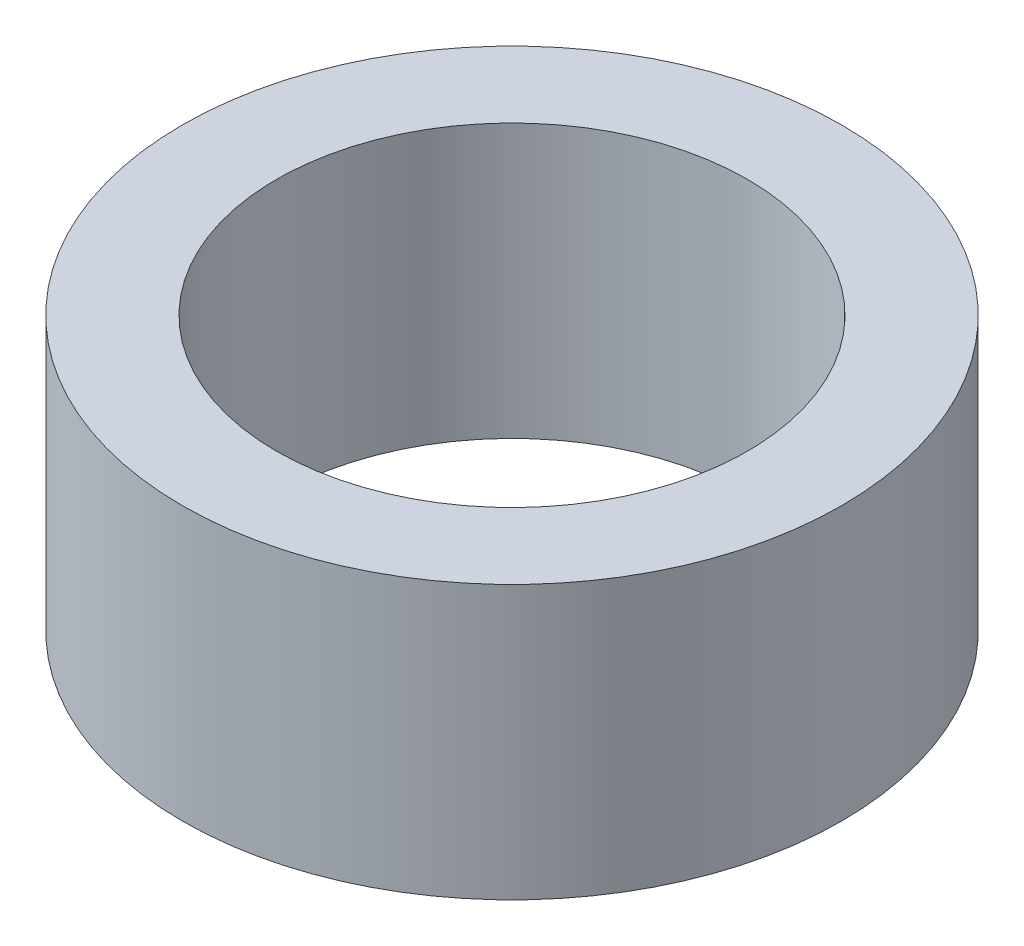
ISO-10303-21;
HEADER;
FILE_DESCRIPTION(('STEP AP214'),'2;1');
FILE_NAME('part.step','',(''),(''),'','','');
FILE_SCHEMA(('AUTOMOTIVE_DESIGN { 1 0 10303 214 1 1 1 1 }'));
ENDSEC;
DATA;
#1=APPLICATION_CONTEXT('core data for automotive mechanical design processes');
#2=APPLICATION_PROTOCOL_DEFINITION('international standard','automotive_design',2000,#1);
#3=PRODUCT_CONTEXT('',#1,'mechanical');
#4=PRODUCT('Part','Part','',(#3));
#5=PRODUCT_RELATED_PRODUCT_CATEGORY('part','',(#4));
#6=PRODUCT_DEFINITION_FORMATION('','',#4);
#7=PRODUCT_DEFINITION_CONTEXT('part definition',#1,'design');
#8=PRODUCT_DEFINITION('design','',#6,#7);
#9=PRODUCT_DEFINITION_SHAPE('','',#8);
#10=(LENGTH_UNIT() NAMED_UNIT(*) SI_UNIT(.MILLI.,.METRE.));
#11=(NAMED_UNIT(*) PLANE_ANGLE_UNIT() SI_UNIT($,.RADIAN.));
#12=(NAMED_UNIT(*) SI_UNIT($,.STERADIAN.) SOLID_ANGLE_UNIT());
#13=UNCERTAINTY_MEASURE_WITH_UNIT(LENGTH_MEASURE(1.E-05),#10,'distance_accuracy_value','');
#14=(GEOMETRIC_REPRESENTATION_CONTEXT(3) GLOBAL_UNCERTAINTY_ASSIGNED_CONTEXT((#13)) GLOBAL_UNIT_ASSIGNED_CONTEXT((#10,
#11,#12)) REPRESENTATION_CONTEXT('',''));
#15=CARTESIAN_POINT('',(0.,0.,0.));
#16=DIRECTION('',(0.,0.,1.));
#17=DIRECTION('',(1.,0.,0.));
#18=AXIS2_PLACEMENT_3D('',#15,#16,#17);
#19=CARTESIAN_POINT('',(0.,8.7,0.));
#20=DIRECTION('',(0.,1.,0.));
#21=DIRECTION('',(0.,0.,1.));
#22=AXIS2_PLACEMENT_3D('',#19,#20,#21);
#23=PLANE('',#22);
#24=CARTESIAN_POINT('',(0.,8.7,0.));
#25=DIRECTION('',(0.,1.,0.));
#26=DIRECTION('',(0.,0.,1.));
#27=AXIS2_PLACEMENT_3D('',#24,#25,#26);
#28=CIRCLE('',#27,10.5);
#29=CARTESIAN_POINT('',(0.,8.7,10.5));
#30=VERTEX_POINT('',#29);
#31=EDGE_CURVE('E10',#30,#30,#28,.T.);
#32=ORIENTED_EDGE('',*,*,#31,.T.);
#33=EDGE_LOOP('',(#32));
#34=FACE_BOUND('',#33,.T.);
#35=CARTESIAN_POINT('',(0.,8.7,0.));
#36=DIRECTION('',(0.,1.,0.));
#37=DIRECTION('',(0.,0.,1.));
#38=AXIS2_PLACEMENT_3D('',#35,#36,#37);
#39=CIRCLE('',#38,7.5);
#40=CARTESIAN_POINT('',(0.,8.7,7.5));
#41=VERTEX_POINT('',#40);
#42=EDGE_CURVE('E46',#41,#41,#39,.T.);
#43=ORIENTED_EDGE('',*,*,#42,.F.);
#44=EDGE_LOOP('',(#43));
#45=FACE_BOUND('',#44,.T.);
#46=ADVANCED_FACE('F35',(#34,#45),#23,.T.);
#47=CARTESIAN_POINT('',(0.,0.,0.));
#48=DIRECTION('',(0.,1.,0.));
#49=DIRECTION('',(0.,0.,1.));
#50=AXIS2_PLACEMENT_3D('',#47,#48,#49);
#51=PLANE('',#50);
#52=CARTESIAN_POINT('',(0.,0.,0.));
#53=DIRECTION('',(0.,1.,0.));
#54=DIRECTION('',(0.,0.,1.));
#55=AXIS2_PLACEMENT_3D('',#52,#53,#54);
#56=CIRCLE('',#55,10.5);
#57=CARTESIAN_POINT('',(0.,0.,10.5));
#58=VERTEX_POINT('',#57);
#59=EDGE_CURVE('E39',#58,#58,#56,.T.);
#60=ORIENTED_EDGE('',*,*,#59,.F.);
#61=EDGE_LOOP('',(#60));
#62=FACE_BOUND('',#61,.T.);
#63=CARTESIAN_POINT('',(0.,0.,0.));
#64=DIRECTION('',(0.,1.,0.));
#65=DIRECTION('',(0.,0.,1.));
#66=AXIS2_PLACEMENT_3D('',#63,#64,#65);
#67=CIRCLE('',#66,7.5);
#68=CARTESIAN_POINT('',(0.,0.,7.5));
#69=VERTEX_POINT('',#68);
#70=EDGE_CURVE('E48',#69,#69,#67,.T.);
#71=ORIENTED_EDGE('',*,*,#70,.T.);
#72=EDGE_LOOP('',(#71));
#73=FACE_BOUND('',#72,.T.);
#74=ADVANCED_FACE('F58',(#62,#73),#51,.F.);
#75=CARTESIAN_POINT('',(0.,8.7,0.));
#76=DIRECTION('',(0.,-1.,0.));
#77=DIRECTION('',(0.,0.,-1.));
#78=AXIS2_PLACEMENT_3D('',#75,#76,#77);
#79=CYLINDRICAL_SURFACE('',#78,10.5);
#80=ORIENTED_EDGE('',*,*,#31,.F.);
#81=EDGE_LOOP('',(#80));
#82=FACE_BOUND('',#81,.T.);
#83=ORIENTED_EDGE('',*,*,#59,.T.);
#84=EDGE_LOOP('',(#83));
#85=FACE_BOUND('',#84,.T.);
#86=ADVANCED_FACE('F37',(#82,#85),#79,.T.);
#87=CARTESIAN_POINT('',(0.,8.7,0.));
#88=DIRECTION('',(0.,-1.,0.));
#89=DIRECTION('',(0.,0.,-1.));
#90=AXIS2_PLACEMENT_3D('',#87,#88,#89);
#91=CYLINDRICAL_SURFACE('',#90,7.5);
#92=ORIENTED_EDGE('',*,*,#42,.T.);
#93=EDGE_LOOP('',(#92));
#94=FACE_BOUND('',#93,.T.);
#95=ORIENTED_EDGE('',*,*,#70,.F.);
#96=EDGE_LOOP('',(#95));
#97=FACE_BOUND('',#96,.T.);
#98=ADVANCED_FACE('F54',(#94,#97),#91,.F.);
#99=CLOSED_SHELL('',(#46,#74,#86,#98));
#100=MANIFOLD_SOLID_BREP('B2',#99);
#101=ADVANCED_BREP_SHAPE_REPRESENTATION('',(#18,#100),#14);
#102=SHAPE_DEFINITION_REPRESENTATION(#9,#101);
ENDSEC;
END-ISO-10303-21;
